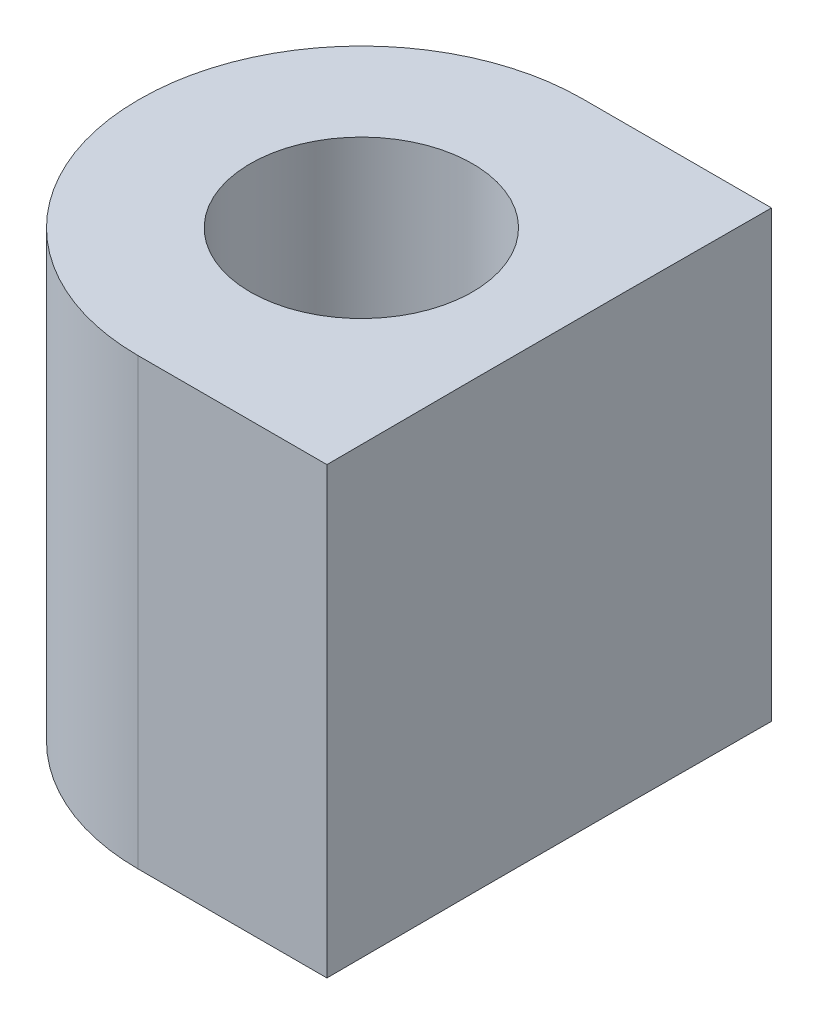
ISO-10303-21;
HEADER;
FILE_DESCRIPTION(('STEP AP214'),'2;1');
FILE_NAME('part.step','',(''),(''),'','','');
FILE_SCHEMA(('AUTOMOTIVE_DESIGN { 1 0 10303 214 1 1 1 1 }'));
ENDSEC;
DATA;
#1=APPLICATION_CONTEXT('core data for automotive mechanical design processes');
#2=APPLICATION_PROTOCOL_DEFINITION('international standard','automotive_design',2000,#1);
#3=PRODUCT_CONTEXT('',#1,'mechanical');
#4=PRODUCT('Part','Part','',(#3));
#5=PRODUCT_RELATED_PRODUCT_CATEGORY('part','',(#4));
#6=PRODUCT_DEFINITION_FORMATION('','',#4);
#7=PRODUCT_DEFINITION_CONTEXT('part definition',#1,'design');
#8=PRODUCT_DEFINITION('design','',#6,#7);
#9=PRODUCT_DEFINITION_SHAPE('','',#8);
#10=(LENGTH_UNIT() NAMED_UNIT(*) SI_UNIT(.MILLI.,.METRE.));
#11=(NAMED_UNIT(*) PLANE_ANGLE_UNIT() SI_UNIT($,.RADIAN.));
#12=(NAMED_UNIT(*) SI_UNIT($,.STERADIAN.) SOLID_ANGLE_UNIT());
#13=UNCERTAINTY_MEASURE_WITH_UNIT(LENGTH_MEASURE(1.E-05),#10,'distance_accuracy_value','');
#14=(GEOMETRIC_REPRESENTATION_CONTEXT(3) GLOBAL_UNCERTAINTY_ASSIGNED_CONTEXT((#13)) GLOBAL_UNIT_ASSIGNED_CONTEXT((#10,
#11,#12)) REPRESENTATION_CONTEXT('',''));
#15=CARTESIAN_POINT('',(0.,0.,0.));
#16=DIRECTION('',(0.,0.,1.));
#17=DIRECTION('',(1.,0.,0.));
#18=AXIS2_PLACEMENT_3D('',#15,#16,#17);
#19=CARTESIAN_POINT('',(-0.0253999999999992,12.7,0.0253999999999992));
#20=DIRECTION('',(0.,1.,0.));
#21=DIRECTION('',(0.,0.,1.));
#22=AXIS2_PLACEMENT_3D('',#19,#20,#21);
#23=PLANE('',#22);
#24=CARTESIAN_POINT('',(-0.0253999999999992,12.7,0.0253999999999992));
#25=DIRECTION('',(0.,1.,0.));
#26=DIRECTION('',(0.,0.,1.));
#27=AXIS2_PLACEMENT_3D('',#24,#25,#26);
#28=CIRCLE('',#27,6.3246);
#29=CARTESIAN_POINT('',(-6.35,12.7,0.0253999999999541));
#30=VERTEX_POINT('',#29);
#31=CARTESIAN_POINT('',(-0.0253999999999541,12.7,6.35));
#32=VERTEX_POINT('',#31);
#33=EDGE_CURVE('E132',#30,#32,#28,.T.);
#34=ORIENTED_EDGE('',*,*,#33,.T.);
#35=DIRECTION('',(1.,0.,0.));
#36=VECTOR('',#35,1.);
#37=CARTESIAN_POINT('',(-0.0253999999999541,12.7,6.35));
#38=LINE('',#37,#36);
#39=CARTESIAN_POINT('',(5.36612910405965,12.7,6.34999999999904));
#40=VERTEX_POINT('',#39);
#41=EDGE_CURVE('E90',#32,#40,#38,.T.);
#42=ORIENTED_EDGE('',*,*,#41,.T.);
#43=CARTESIAN_POINT('',(1255.35,12.7,0.));
#44=DIRECTION('',(0.,-1.,0.));
#45=DIRECTION('',(0.,0.,1.));
#46=AXIS2_PLACEMENT_3D('',#43,#44,#45);
#47=CIRCLE('',#46,1250.);
#48=CARTESIAN_POINT('',(5.36612910405965,12.7,-6.35));
#49=VERTEX_POINT('',#48);
#50=EDGE_CURVE('E103',#40,#49,#47,.T.);
#51=ORIENTED_EDGE('',*,*,#50,.T.);
#52=DIRECTION('',(-1.,0.,0.));
#53=VECTOR('',#52,1.);
#54=CARTESIAN_POINT('',(-0.0253999999999541,12.7,-6.35));
#55=LINE('',#54,#53);
#56=CARTESIAN_POINT('',(-0.0253999999999554,12.7,-6.35));
#57=VERTEX_POINT('',#56);
#58=EDGE_CURVE('E97',#49,#57,#55,.T.);
#59=ORIENTED_EDGE('',*,*,#58,.T.);
#60=CARTESIAN_POINT('',(-0.0253999999999983,12.7,-0.0254000000000009));
#61=DIRECTION('',(0.,1.,0.));
#62=DIRECTION('',(0.,0.,1.));
#63=AXIS2_PLACEMENT_3D('',#60,#61,#62);
#64=CIRCLE('',#63,6.3246);
#65=CARTESIAN_POINT('',(-6.35,12.7,-0.0253999999999567));
#66=VERTEX_POINT('',#65);
#67=EDGE_CURVE('E101',#57,#66,#64,.T.);
#68=ORIENTED_EDGE('',*,*,#67,.T.);
#69=DIRECTION('',(0.,0.,1.));
#70=VECTOR('',#69,1.);
#71=CARTESIAN_POINT('',(-6.35,12.7,0.0253999999999541));
#72=LINE('',#71,#70);
#73=EDGE_CURVE('E53',#66,#30,#72,.T.);
#74=ORIENTED_EDGE('',*,*,#73,.T.);
#75=EDGE_LOOP('',(#34,#42,#51,#59,#68,#74));
#76=FACE_BOUND('',#75,.T.);
#77=CARTESIAN_POINT('',(0.,12.7,0.));
#78=DIRECTION('',(0.,1.,0.));
#79=DIRECTION('',(0.,0.,1.));
#80=AXIS2_PLACEMENT_3D('',#77,#78,#79);
#81=CIRCLE('',#80,3.175);
#82=CARTESIAN_POINT('',(0.,12.7,3.175));
#83=VERTEX_POINT('',#82);
#84=EDGE_CURVE('E125',#83,#83,#81,.T.);
#85=ORIENTED_EDGE('',*,*,#84,.F.);
#86=EDGE_LOOP('',(#85));
#87=FACE_BOUND('',#86,.T.);
#88=ADVANCED_FACE('F36',(#76,#87),#23,.T.);
#89=CARTESIAN_POINT('',(-0.0253999999999992,0.,0.0253999999999992));
#90=DIRECTION('',(0.,1.,0.));
#91=DIRECTION('',(0.,0.,1.));
#92=AXIS2_PLACEMENT_3D('',#89,#90,#91);
#93=PLANE('',#92);
#94=CARTESIAN_POINT('',(-0.0253999999999992,0.,0.0253999999999992));
#95=DIRECTION('',(0.,1.,0.));
#96=DIRECTION('',(0.,0.,1.));
#97=AXIS2_PLACEMENT_3D('',#94,#95,#96);
#98=CIRCLE('',#97,6.3246);
#99=CARTESIAN_POINT('',(-6.35,0.,0.0253999999999541));
#100=VERTEX_POINT('',#99);
#101=CARTESIAN_POINT('',(-0.0253999999999541,0.,6.35));
#102=VERTEX_POINT('',#101);
#103=EDGE_CURVE('E121',#100,#102,#98,.T.);
#104=ORIENTED_EDGE('',*,*,#103,.F.);
#105=DIRECTION('',(0.,0.,1.));
#106=VECTOR('',#105,1.);
#107=CARTESIAN_POINT('',(-6.35,0.,0.0253999999999541));
#108=LINE('',#107,#106);
#109=CARTESIAN_POINT('',(-6.35,0.,-0.0253999999999567));
#110=VERTEX_POINT('',#109);
#111=EDGE_CURVE('E82',#110,#100,#108,.T.);
#112=ORIENTED_EDGE('',*,*,#111,.F.);
#113=CARTESIAN_POINT('',(-0.0253999999999983,0.,-0.0254000000000009));
#114=DIRECTION('',(0.,1.,0.));
#115=DIRECTION('',(0.,0.,1.));
#116=AXIS2_PLACEMENT_3D('',#113,#114,#115);
#117=CIRCLE('',#116,6.3246);
#118=CARTESIAN_POINT('',(-0.0253999999999554,0.,-6.35));
#119=VERTEX_POINT('',#118);
#120=EDGE_CURVE('E76',#119,#110,#117,.T.);
#121=ORIENTED_EDGE('',*,*,#120,.F.);
#122=DIRECTION('',(-1.,0.,0.));
#123=VECTOR('',#122,1.);
#124=CARTESIAN_POINT('',(-0.0253999999999541,0.,-6.35));
#125=LINE('',#124,#123);
#126=CARTESIAN_POINT('',(5.36612910405965,0.,-6.35));
#127=VERTEX_POINT('',#126);
#128=EDGE_CURVE('E111',#127,#119,#125,.T.);
#129=ORIENTED_EDGE('',*,*,#128,.F.);
#130=CARTESIAN_POINT('',(1255.35,0.,0.));
#131=DIRECTION('',(0.,-1.,0.));
#132=DIRECTION('',(0.,0.,1.));
#133=AXIS2_PLACEMENT_3D('',#130,#131,#132);
#134=CIRCLE('',#133,1250.);
#135=CARTESIAN_POINT('',(5.36612910405965,0.,6.34999999999904));
#136=VERTEX_POINT('',#135);
#137=EDGE_CURVE('E127',#136,#127,#134,.T.);
#138=ORIENTED_EDGE('',*,*,#137,.F.);
#139=DIRECTION('',(1.,0.,0.));
#140=VECTOR('',#139,1.);
#141=CARTESIAN_POINT('',(-0.0253999999999541,0.,6.35));
#142=LINE('',#141,#140);
#143=EDGE_CURVE('E124',#102,#136,#142,.T.);
#144=ORIENTED_EDGE('',*,*,#143,.F.);
#145=EDGE_LOOP('',(#104,#112,#121,#129,#138,#144));
#146=FACE_BOUND('',#145,.T.);
#147=CARTESIAN_POINT('',(0.,0.,0.));
#148=DIRECTION('',(0.,1.,0.));
#149=DIRECTION('',(0.,0.,1.));
#150=AXIS2_PLACEMENT_3D('',#147,#148,#149);
#151=CIRCLE('',#150,3.175);
#152=CARTESIAN_POINT('',(0.,0.,3.175));
#153=VERTEX_POINT('',#152);
#154=EDGE_CURVE('E243',#153,#153,#151,.T.);
#155=ORIENTED_EDGE('',*,*,#154,.T.);
#156=EDGE_LOOP('',(#155));
#157=FACE_BOUND('',#156,.T.);
#158=ADVANCED_FACE('F141',(#146,#157),#93,.F.);
#159=CARTESIAN_POINT('',(-0.0253999999999992,12.7,0.0253999999999992));
#160=DIRECTION('',(0.,-1.,0.));
#161=DIRECTION('',(0.,0.,-1.));
#162=AXIS2_PLACEMENT_3D('',#159,#160,#161);
#163=CYLINDRICAL_SURFACE('',#162,6.3246);
#164=ORIENTED_EDGE('',*,*,#103,.T.);
#165=DIRECTION('',(0.,-1.,0.));
#166=VECTOR('',#165,1.);
#167=CARTESIAN_POINT('',(-0.0253999999999541,12.7,6.35));
#168=LINE('',#167,#166);
#169=EDGE_CURVE('E11',#32,#102,#168,.T.);
#170=ORIENTED_EDGE('',*,*,#169,.F.);
#171=ORIENTED_EDGE('',*,*,#33,.F.);
#172=DIRECTION('',(0.,-1.,0.));
#173=VECTOR('',#172,1.);
#174=CARTESIAN_POINT('',(-6.35,12.7,0.0253999999999541));
#175=LINE('',#174,#173);
#176=EDGE_CURVE('E117',#30,#100,#175,.T.);
#177=ORIENTED_EDGE('',*,*,#176,.T.);
#178=EDGE_LOOP('',(#164,#170,#171,#177));
#179=FACE_BOUND('',#178,.T.);
#180=ADVANCED_FACE('F38',(#179),#163,.T.);
#181=CARTESIAN_POINT('',(-0.0253999999999541,12.7,6.35));
#182=DIRECTION('',(0.,0.,-1.));
#183=DIRECTION('',(-1.,0.,0.));
#184=AXIS2_PLACEMENT_3D('',#181,#182,#183);
#185=PLANE('',#184);
#186=ORIENTED_EDGE('',*,*,#143,.T.);
#187=DIRECTION('',(0.,-1.,0.));
#188=VECTOR('',#187,1.);
#189=CARTESIAN_POINT('',(5.36612910405965,12.7,6.34999999999904));
#190=LINE('',#189,#188);
#191=EDGE_CURVE('E45',#40,#136,#190,.T.);
#192=ORIENTED_EDGE('',*,*,#191,.F.);
#193=ORIENTED_EDGE('',*,*,#41,.F.);
#194=ORIENTED_EDGE('',*,*,#169,.T.);
#195=EDGE_LOOP('',(#186,#192,#193,#194));
#196=FACE_BOUND('',#195,.T.);
#197=ADVANCED_FACE('F166',(#196),#185,.F.);
#198=CARTESIAN_POINT('',(1255.35,12.7,0.));
#199=DIRECTION('',(0.,-1.,0.));
#200=DIRECTION('',(0.,0.,-1.));
#201=AXIS2_PLACEMENT_3D('',#198,#199,#200);
#202=CYLINDRICAL_SURFACE('',#201,1250.);
#203=ORIENTED_EDGE('',*,*,#137,.T.);
#204=DIRECTION('',(0.,-1.,0.));
#205=VECTOR('',#204,1.);
#206=CARTESIAN_POINT('',(5.36612910405965,12.7,-6.35));
#207=LINE('',#206,#205);
#208=EDGE_CURVE('E112',#49,#127,#207,.T.);
#209=ORIENTED_EDGE('',*,*,#208,.F.);
#210=ORIENTED_EDGE('',*,*,#50,.F.);
#211=ORIENTED_EDGE('',*,*,#191,.T.);
#212=EDGE_LOOP('',(#203,#209,#210,#211));
#213=FACE_BOUND('',#212,.T.);
#214=ADVANCED_FACE('F138',(#213),#202,.F.);
#215=CARTESIAN_POINT('',(-0.0253999999999541,12.7,-6.35));
#216=DIRECTION('',(0.,0.,1.));
#217=DIRECTION('',(1.,0.,0.));
#218=AXIS2_PLACEMENT_3D('',#215,#216,#217);
#219=PLANE('',#218);
#220=ORIENTED_EDGE('',*,*,#128,.T.);
#221=DIRECTION('',(0.,-1.,0.));
#222=VECTOR('',#221,1.);
#223=CARTESIAN_POINT('',(-0.0253999999999554,12.7,-6.35));
#224=LINE('',#223,#222);
#225=EDGE_CURVE('E108',#57,#119,#224,.T.);
#226=ORIENTED_EDGE('',*,*,#225,.F.);
#227=ORIENTED_EDGE('',*,*,#58,.F.);
#228=ORIENTED_EDGE('',*,*,#208,.T.);
#229=EDGE_LOOP('',(#220,#226,#227,#228));
#230=FACE_BOUND('',#229,.T.);
#231=ADVANCED_FACE('F109',(#230),#219,.F.);
#232=CARTESIAN_POINT('',(-0.0253999999999983,12.7,-0.0254000000000009));
#233=DIRECTION('',(0.,-1.,0.));
#234=DIRECTION('',(0.,0.,-1.));
#235=AXIS2_PLACEMENT_3D('',#232,#233,#234);
#236=CYLINDRICAL_SURFACE('',#235,6.3246);
#237=ORIENTED_EDGE('',*,*,#120,.T.);
#238=DIRECTION('',(0.,-1.,0.));
#239=VECTOR('',#238,1.);
#240=CARTESIAN_POINT('',(-6.35,12.7,-0.0253999999999567));
#241=LINE('',#240,#239);
#242=EDGE_CURVE('E113',#66,#110,#241,.T.);
#243=ORIENTED_EDGE('',*,*,#242,.F.);
#244=ORIENTED_EDGE('',*,*,#67,.F.);
#245=ORIENTED_EDGE('',*,*,#225,.T.);
#246=EDGE_LOOP('',(#237,#243,#244,#245));
#247=FACE_BOUND('',#246,.T.);
#248=ADVANCED_FACE('F115',(#247),#236,.T.);
#249=CARTESIAN_POINT('',(-6.35,12.7,0.0253999999999541));
#250=DIRECTION('',(1.,0.,0.));
#251=DIRECTION('',(0.,0.,-1.));
#252=AXIS2_PLACEMENT_3D('',#249,#250,#251);
#253=PLANE('',#252);
#254=ORIENTED_EDGE('',*,*,#111,.T.);
#255=ORIENTED_EDGE('',*,*,#176,.F.);
#256=ORIENTED_EDGE('',*,*,#73,.F.);
#257=ORIENTED_EDGE('',*,*,#242,.T.);
#258=EDGE_LOOP('',(#254,#255,#256,#257));
#259=FACE_BOUND('',#258,.T.);
#260=ADVANCED_FACE('F146',(#259),#253,.F.);
#261=CARTESIAN_POINT('',(0.,12.7,0.));
#262=DIRECTION('',(0.,-1.,0.));
#263=DIRECTION('',(0.,0.,-1.));
#264=AXIS2_PLACEMENT_3D('',#261,#262,#263);
#265=CYLINDRICAL_SURFACE('',#264,3.175);
#266=ORIENTED_EDGE('',*,*,#84,.T.);
#267=EDGE_LOOP('',(#266));
#268=FACE_BOUND('',#267,.T.);
#269=ORIENTED_EDGE('',*,*,#154,.F.);
#270=EDGE_LOOP('',(#269));
#271=FACE_BOUND('',#270,.T.);
#272=ADVANCED_FACE('F148',(#268,#271),#265,.F.);
#273=CLOSED_SHELL('',(#88,#158,#180,#197,#214,#231,#248,#260,#272));
#274=MANIFOLD_SOLID_BREP('B2',#273);
#275=ADVANCED_BREP_SHAPE_REPRESENTATION('',(#18,#274),#14);
#276=SHAPE_DEFINITION_REPRESENTATION(#9,#275);
ENDSEC;
END-ISO-10303-21;
